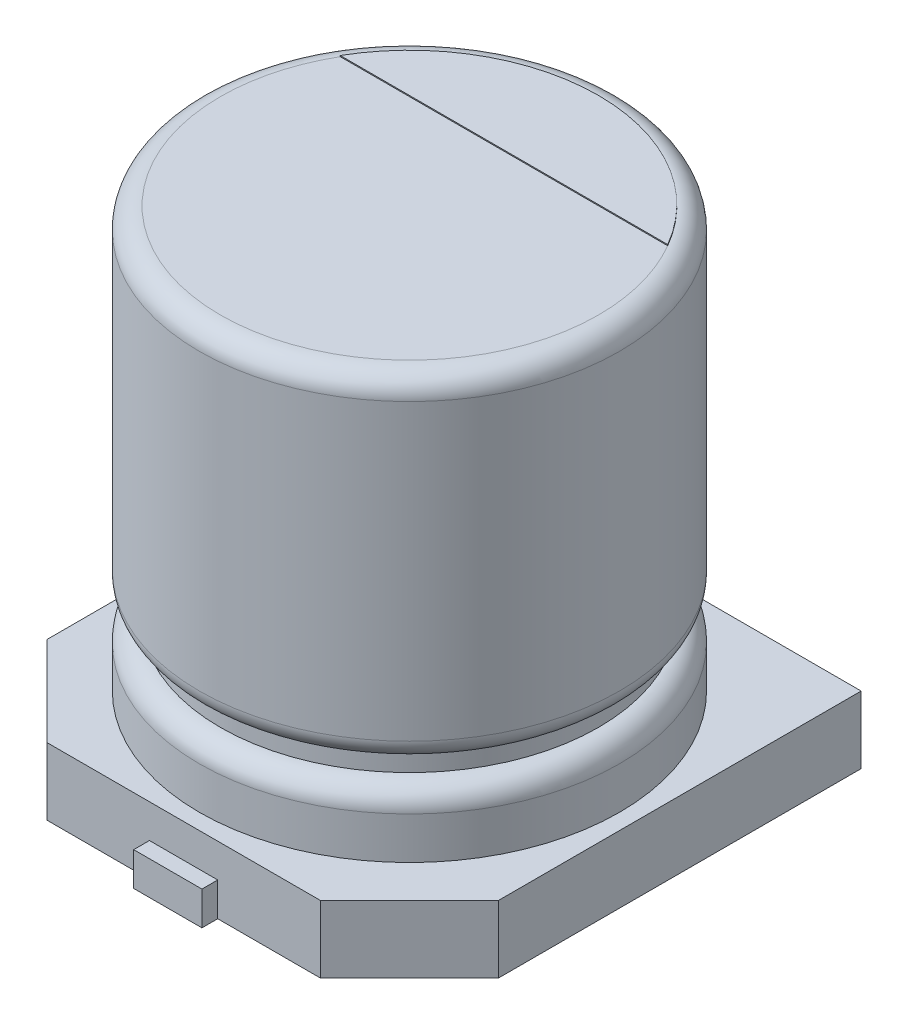
ISO-10303-21;
HEADER;
FILE_DESCRIPTION(('STEP AP214'),'2;1');
FILE_NAME('part.step','',(''),(''),'','','');
FILE_SCHEMA(('AUTOMOTIVE_DESIGN { 1 0 10303 214 1 1 1 1 }'));
ENDSEC;
DATA;
#1=APPLICATION_CONTEXT('core data for automotive mechanical design processes');
#2=APPLICATION_PROTOCOL_DEFINITION('international standard','automotive_design',2000,#1);
#3=PRODUCT_CONTEXT('',#1,'mechanical');
#4=PRODUCT('Part','Part','',(#3));
#5=PRODUCT_RELATED_PRODUCT_CATEGORY('part','',(#4));
#6=PRODUCT_DEFINITION_FORMATION('','',#4);
#7=PRODUCT_DEFINITION_CONTEXT('part definition',#1,'design');
#8=PRODUCT_DEFINITION('design','',#6,#7);
#9=PRODUCT_DEFINITION_SHAPE('','',#8);
#10=(LENGTH_UNIT() NAMED_UNIT(*) SI_UNIT(.MILLI.,.METRE.));
#11=(NAMED_UNIT(*) PLANE_ANGLE_UNIT() SI_UNIT($,.RADIAN.));
#12=(NAMED_UNIT(*) SI_UNIT($,.STERADIAN.) SOLID_ANGLE_UNIT());
#13=UNCERTAINTY_MEASURE_WITH_UNIT(LENGTH_MEASURE(1.E-05),#10,'distance_accuracy_value','');
#14=(GEOMETRIC_REPRESENTATION_CONTEXT(3) GLOBAL_UNCERTAINTY_ASSIGNED_CONTEXT((#13)) GLOBAL_UNIT_ASSIGNED_CONTEXT((#10,
#11,#12)) REPRESENTATION_CONTEXT('',''));
#15=CARTESIAN_POINT('',(0.,0.,0.));
#16=DIRECTION('',(0.,0.,1.));
#17=DIRECTION('',(1.,0.,0.));
#18=AXIS2_PLACEMENT_3D('',#15,#16,#17);
#19=CARTESIAN_POINT('',(-0.325,-0.64,-2.3));
#20=DIRECTION('',(0.,0.,1.));
#21=DIRECTION('',(0.,-1.,0.));
#22=AXIS2_PLACEMENT_3D('',#19,#20,#21);
#23=PLANE('',#22);
#24=DIRECTION('',(0.,1.,0.));
#25=VECTOR('',#24,1.);
#26=CARTESIAN_POINT('',(0.325,-0.64,-2.3));
#27=LINE('',#26,#25);
#28=CARTESIAN_POINT('',(0.325,-0.32,-2.3));
#29=VERTEX_POINT('',#28);
#30=CARTESIAN_POINT('',(0.325,-0.64,-2.3));
#31=VERTEX_POINT('',#30);
#32=EDGE_CURVE('E248',#29,#31,#27,.F.);
#33=ORIENTED_EDGE('',*,*,#32,.T.);
#34=DIRECTION('',(1.,0.,0.));
#35=VECTOR('',#34,1.);
#36=CARTESIAN_POINT('',(0.,-0.64,-2.3));
#37=LINE('',#36,#35);
#38=CARTESIAN_POINT('',(-0.325,-0.64,-2.3));
#39=VERTEX_POINT('',#38);
#40=EDGE_CURVE('E235',#39,#31,#37,.T.);
#41=ORIENTED_EDGE('',*,*,#40,.F.);
#42=DIRECTION('',(0.,1.,0.));
#43=VECTOR('',#42,1.);
#44=CARTESIAN_POINT('',(-0.325,-0.64,-2.3));
#45=LINE('',#44,#43);
#46=CARTESIAN_POINT('',(-0.325,-0.32,-2.3));
#47=VERTEX_POINT('',#46);
#48=EDGE_CURVE('E238',#39,#47,#45,.T.);
#49=ORIENTED_EDGE('',*,*,#48,.T.);
#50=DIRECTION('',(1.,0.,0.));
#51=VECTOR('',#50,1.);
#52=CARTESIAN_POINT('',(0.,-0.32,-2.3));
#53=LINE('',#52,#51);
#54=EDGE_CURVE('E243',#47,#29,#53,.T.);
#55=ORIENTED_EDGE('',*,*,#54,.T.);
#56=EDGE_LOOP('',(#33,#41,#49,#55));
#57=FACE_BOUND('',#56,.T.);
#58=ADVANCED_FACE('F17',(#57),#23,.F.);
#59=CARTESIAN_POINT('',(-0.325,-0.64,2.3));
#60=DIRECTION('',(0.,0.,-1.));
#61=DIRECTION('',(0.,1.,0.));
#62=AXIS2_PLACEMENT_3D('',#59,#60,#61);
#63=PLANE('',#62);
#64=DIRECTION('',(0.,1.,0.));
#65=VECTOR('',#64,1.);
#66=CARTESIAN_POINT('',(-0.325,-0.64,2.3));
#67=LINE('',#66,#65);
#68=CARTESIAN_POINT('',(-0.325,-0.32,2.3));
#69=VERTEX_POINT('',#68);
#70=CARTESIAN_POINT('',(-0.325,-0.64,2.3));
#71=VERTEX_POINT('',#70);
#72=EDGE_CURVE('E265',#69,#71,#67,.F.);
#73=ORIENTED_EDGE('',*,*,#72,.T.);
#74=DIRECTION('',(1.,0.,0.));
#75=VECTOR('',#74,1.);
#76=CARTESIAN_POINT('',(0.,-0.64,2.3));
#77=LINE('',#76,#75);
#78=CARTESIAN_POINT('',(0.325,-0.64,2.3));
#79=VERTEX_POINT('',#78);
#80=EDGE_CURVE('E232',#79,#71,#77,.F.);
#81=ORIENTED_EDGE('',*,*,#80,.F.);
#82=DIRECTION('',(0.,1.,0.));
#83=VECTOR('',#82,1.);
#84=CARTESIAN_POINT('',(0.325,-0.64,2.3));
#85=LINE('',#84,#83);
#86=CARTESIAN_POINT('',(0.325,-0.32,2.3));
#87=VERTEX_POINT('',#86);
#88=EDGE_CURVE('E255',#79,#87,#85,.T.);
#89=ORIENTED_EDGE('',*,*,#88,.T.);
#90=DIRECTION('',(1.,0.,0.));
#91=VECTOR('',#90,1.);
#92=CARTESIAN_POINT('',(0.,-0.32,2.3));
#93=LINE('',#92,#91);
#94=EDGE_CURVE('E260',#87,#69,#93,.F.);
#95=ORIENTED_EDGE('',*,*,#94,.T.);
#96=EDGE_LOOP('',(#73,#81,#89,#95));
#97=FACE_BOUND('',#96,.T.);
#98=ADVANCED_FACE('F557',(#97),#63,.F.);
#99=CARTESIAN_POINT('',(-0.325,-0.64,-0.5));
#100=DIRECTION('',(1.,0.,0.));
#101=DIRECTION('',(0.,0.,-1.));
#102=AXIS2_PLACEMENT_3D('',#99,#100,#101);
#103=PLANE('',#102);
#104=DIRECTION('',(0.,1.,0.));
#105=VECTOR('',#104,1.);
#106=CARTESIAN_POINT('',(-0.325,-0.64,-2.15));
#107=LINE('',#106,#105);
#108=CARTESIAN_POINT('',(-0.325,-0.64,-2.15));
#109=VERTEX_POINT('',#108);
#110=CARTESIAN_POINT('',(-0.325,-0.32,-2.15));
#111=VERTEX_POINT('',#110);
#112=EDGE_CURVE('E276',#109,#111,#107,.T.);
#113=ORIENTED_EDGE('',*,*,#112,.T.);
#114=DIRECTION('',(0.,0.,-1.));
#115=VECTOR('',#114,1.);
#116=CARTESIAN_POINT('',(-0.325,-0.32,0.));
#117=LINE('',#116,#115);
#118=EDGE_CURVE('E245',#111,#47,#117,.T.);
#119=ORIENTED_EDGE('',*,*,#118,.T.);
#120=ORIENTED_EDGE('',*,*,#48,.F.);
#121=DIRECTION('',(0.,0.,-1.));
#122=VECTOR('',#121,1.);
#123=CARTESIAN_POINT('',(-0.325,-0.64,-0.5));
#124=LINE('',#123,#122);
#125=EDGE_CURVE('E240',#109,#39,#124,.T.);
#126=ORIENTED_EDGE('',*,*,#125,.F.);
#127=EDGE_LOOP('',(#113,#119,#120,#126));
#128=FACE_BOUND('',#127,.T.);
#129=ADVANCED_FACE('F376',(#128),#103,.F.);
#130=CARTESIAN_POINT('',(0.,-0.32,0.));
#131=DIRECTION('',(0.,-1.,0.));
#132=DIRECTION('',(0.,0.,-1.));
#133=AXIS2_PLACEMENT_3D('',#130,#131,#132);
#134=PLANE('',#133);
#135=DIRECTION('',(1.,0.,0.));
#136=VECTOR('',#135,1.);
#137=CARTESIAN_POINT('',(-2.15,-0.32,-2.15));
#138=LINE('',#137,#136);
#139=CARTESIAN_POINT('',(0.325,-0.32,-2.15));
#140=VERTEX_POINT('',#139);
#141=EDGE_CURVE('E278',#111,#140,#138,.T.);
#142=ORIENTED_EDGE('',*,*,#141,.T.);
#143=DIRECTION('',(0.,0.,1.));
#144=VECTOR('',#143,1.);
#145=CARTESIAN_POINT('',(0.325,-0.32,-0.5));
#146=LINE('',#145,#144);
#147=EDGE_CURVE('E252',#140,#29,#146,.F.);
#148=ORIENTED_EDGE('',*,*,#147,.T.);
#149=ORIENTED_EDGE('',*,*,#54,.F.);
#150=ORIENTED_EDGE('',*,*,#118,.F.);
#151=EDGE_LOOP('',(#142,#148,#149,#150));
#152=FACE_BOUND('',#151,.T.);
#153=ADVANCED_FACE('F372',(#152),#134,.F.);
#154=CARTESIAN_POINT('',(0.325,-0.64,-0.5));
#155=DIRECTION('',(-1.,0.,0.));
#156=DIRECTION('',(0.,0.,1.));
#157=AXIS2_PLACEMENT_3D('',#154,#155,#156);
#158=PLANE('',#157);
#159=DIRECTION('',(0.,1.,0.));
#160=VECTOR('',#159,1.);
#161=CARTESIAN_POINT('',(0.325,-0.64,-2.15));
#162=LINE('',#161,#160);
#163=CARTESIAN_POINT('',(0.325,-0.64,-2.15));
#164=VERTEX_POINT('',#163);
#165=EDGE_CURVE('E280',#140,#164,#162,.F.);
#166=ORIENTED_EDGE('',*,*,#165,.T.);
#167=DIRECTION('',(0.,0.,1.));
#168=VECTOR('',#167,1.);
#169=CARTESIAN_POINT('',(0.325,-0.64,-0.5));
#170=LINE('',#169,#168);
#171=EDGE_CURVE('E250',#31,#164,#170,.T.);
#172=ORIENTED_EDGE('',*,*,#171,.F.);
#173=ORIENTED_EDGE('',*,*,#32,.F.);
#174=ORIENTED_EDGE('',*,*,#147,.F.);
#175=EDGE_LOOP('',(#166,#172,#173,#174));
#176=FACE_BOUND('',#175,.T.);
#177=ADVANCED_FACE('F368',(#176),#158,.F.);
#178=CARTESIAN_POINT('',(0.325,-0.64,0.5));
#179=DIRECTION('',(-1.,0.,0.));
#180=DIRECTION('',(0.,0.,1.));
#181=AXIS2_PLACEMENT_3D('',#178,#179,#180);
#182=PLANE('',#181);
#183=DIRECTION('',(0.,1.,0.));
#184=VECTOR('',#183,1.);
#185=CARTESIAN_POINT('',(0.325,-0.64,2.15));
#186=LINE('',#185,#184);
#187=CARTESIAN_POINT('',(0.325,-0.64,2.15));
#188=VERTEX_POINT('',#187);
#189=CARTESIAN_POINT('',(0.325,-0.32,2.15));
#190=VERTEX_POINT('',#189);
#191=EDGE_CURVE('E300',#188,#190,#186,.T.);
#192=ORIENTED_EDGE('',*,*,#191,.T.);
#193=DIRECTION('',(0.,0.,-1.));
#194=VECTOR('',#193,1.);
#195=CARTESIAN_POINT('',(0.325,-0.32,0.));
#196=LINE('',#195,#194);
#197=EDGE_CURVE('E262',#190,#87,#196,.F.);
#198=ORIENTED_EDGE('',*,*,#197,.T.);
#199=ORIENTED_EDGE('',*,*,#88,.F.);
#200=DIRECTION('',(0.,0.,1.));
#201=VECTOR('',#200,1.);
#202=CARTESIAN_POINT('',(0.325,-0.64,0.5));
#203=LINE('',#202,#201);
#204=EDGE_CURVE('E257',#188,#79,#203,.T.);
#205=ORIENTED_EDGE('',*,*,#204,.F.);
#206=EDGE_LOOP('',(#192,#198,#199,#205));
#207=FACE_BOUND('',#206,.T.);
#208=ADVANCED_FACE('F522',(#207),#182,.F.);
#209=CARTESIAN_POINT('',(0.,-0.32,0.));
#210=DIRECTION('',(0.,-1.,0.));
#211=DIRECTION('',(0.,0.,-1.));
#212=AXIS2_PLACEMENT_3D('',#209,#210,#211);
#213=PLANE('',#212);
#214=DIRECTION('',(-1.,0.,0.));
#215=VECTOR('',#214,1.);
#216=CARTESIAN_POINT('',(1.30147186257614,-0.32,2.15));
#217=LINE('',#216,#215);
#218=CARTESIAN_POINT('',(-0.325,-0.32,2.15));
#219=VERTEX_POINT('',#218);
#220=EDGE_CURVE('E302',#190,#219,#217,.T.);
#221=ORIENTED_EDGE('',*,*,#220,.T.);
#222=DIRECTION('',(0.,0.,-1.));
#223=VECTOR('',#222,1.);
#224=CARTESIAN_POINT('',(-0.325,-0.32,0.5));
#225=LINE('',#224,#223);
#226=EDGE_CURVE('E269',#219,#69,#225,.F.);
#227=ORIENTED_EDGE('',*,*,#226,.T.);
#228=ORIENTED_EDGE('',*,*,#94,.F.);
#229=ORIENTED_EDGE('',*,*,#197,.F.);
#230=EDGE_LOOP('',(#221,#227,#228,#229));
#231=FACE_BOUND('',#230,.T.);
#232=ADVANCED_FACE('F512',(#231),#213,.F.);
#233=CARTESIAN_POINT('',(-0.325,-0.64,0.5));
#234=DIRECTION('',(1.,0.,0.));
#235=DIRECTION('',(0.,0.,-1.));
#236=AXIS2_PLACEMENT_3D('',#233,#234,#235);
#237=PLANE('',#236);
#238=DIRECTION('',(0.,1.,0.));
#239=VECTOR('',#238,1.);
#240=CARTESIAN_POINT('',(-0.325,-0.64,2.15));
#241=LINE('',#240,#239);
#242=CARTESIAN_POINT('',(-0.325,-0.64,2.15));
#243=VERTEX_POINT('',#242);
#244=EDGE_CURVE('E304',#219,#243,#241,.F.);
#245=ORIENTED_EDGE('',*,*,#244,.T.);
#246=DIRECTION('',(0.,0.,-1.));
#247=VECTOR('',#246,1.);
#248=CARTESIAN_POINT('',(-0.325,-0.64,0.5));
#249=LINE('',#248,#247);
#250=EDGE_CURVE('E267',#71,#243,#249,.T.);
#251=ORIENTED_EDGE('',*,*,#250,.F.);
#252=ORIENTED_EDGE('',*,*,#72,.F.);
#253=ORIENTED_EDGE('',*,*,#226,.F.);
#254=EDGE_LOOP('',(#245,#251,#252,#253));
#255=FACE_BOUND('',#254,.T.);
#256=ADVANCED_FACE('F503',(#255),#237,.F.);
#257=CARTESIAN_POINT('',(0.,-0.64,0.));
#258=DIRECTION('',(0.,-1.,0.));
#259=DIRECTION('',(1.,0.,0.));
#260=AXIS2_PLACEMENT_3D('',#257,#258,#259);
#261=PLANE('',#260);
#262=DIRECTION('',(0.,0.,1.));
#263=VECTOR('',#262,1.);
#264=CARTESIAN_POINT('',(2.15,-0.64,-2.15));
#265=LINE('',#264,#263);
#266=CARTESIAN_POINT('',(2.15,-0.64,-2.15));
#267=VERTEX_POINT('',#266);
#268=CARTESIAN_POINT('',(2.15,-0.64,1.30147186257614));
#269=VERTEX_POINT('',#268);
#270=EDGE_CURVE('E286',#267,#269,#265,.T.);
#271=ORIENTED_EDGE('',*,*,#270,.T.);
#272=DIRECTION('',(-0.707106781186546,0.,0.707106781186549));
#273=VECTOR('',#272,1.);
#274=CARTESIAN_POINT('',(2.15,-0.64,1.30147186257614));
#275=LINE('',#274,#273);
#276=CARTESIAN_POINT('',(1.30147186257614,-0.64,2.15));
#277=VERTEX_POINT('',#276);
#278=EDGE_CURVE('E291',#269,#277,#275,.T.);
#279=ORIENTED_EDGE('',*,*,#278,.T.);
#280=DIRECTION('',(-1.,0.,0.));
#281=VECTOR('',#280,1.);
#282=CARTESIAN_POINT('',(1.30147186257614,-0.64,2.15));
#283=LINE('',#282,#281);
#284=EDGE_CURVE('E298',#277,#188,#283,.T.);
#285=ORIENTED_EDGE('',*,*,#284,.T.);
#286=ORIENTED_EDGE('',*,*,#204,.T.);
#287=ORIENTED_EDGE('',*,*,#80,.T.);
#288=ORIENTED_EDGE('',*,*,#250,.T.);
#289=DIRECTION('',(-1.,0.,0.));
#290=VECTOR('',#289,1.);
#291=CARTESIAN_POINT('',(1.30147186257614,-0.64,2.15));
#292=LINE('',#291,#290);
#293=CARTESIAN_POINT('',(-1.30147186257614,-0.64,2.15));
#294=VERTEX_POINT('',#293);
#295=EDGE_CURVE('E293',#243,#294,#292,.T.);
#296=ORIENTED_EDGE('',*,*,#295,.T.);
#297=DIRECTION('',(-0.707106781186546,0.,-0.707106781186549));
#298=VECTOR('',#297,1.);
#299=CARTESIAN_POINT('',(-1.30147186257614,-0.64,2.15));
#300=LINE('',#299,#298);
#301=CARTESIAN_POINT('',(-2.15,-0.64,1.30147186257614));
#302=VERTEX_POINT('',#301);
#303=EDGE_CURVE('E310',#294,#302,#300,.T.);
#304=ORIENTED_EDGE('',*,*,#303,.T.);
#305=DIRECTION('',(0.,0.,1.));
#306=VECTOR('',#305,1.);
#307=CARTESIAN_POINT('',(-2.15,-0.64,1.30147186257614));
#308=LINE('',#307,#306);
#309=CARTESIAN_POINT('',(-2.15,-0.64,-2.15));
#310=VERTEX_POINT('',#309);
#311=EDGE_CURVE('E315',#302,#310,#308,.F.);
#312=ORIENTED_EDGE('',*,*,#311,.T.);
#313=DIRECTION('',(1.,0.,0.));
#314=VECTOR('',#313,1.);
#315=CARTESIAN_POINT('',(-2.15,-0.64,-2.15));
#316=LINE('',#315,#314);
#317=EDGE_CURVE('E274',#310,#109,#316,.T.);
#318=ORIENTED_EDGE('',*,*,#317,.T.);
#319=ORIENTED_EDGE('',*,*,#125,.T.);
#320=ORIENTED_EDGE('',*,*,#40,.T.);
#321=ORIENTED_EDGE('',*,*,#171,.T.);
#322=DIRECTION('',(1.,0.,0.));
#323=VECTOR('',#322,1.);
#324=CARTESIAN_POINT('',(-2.15,-0.64,-2.15));
#325=LINE('',#324,#323);
#326=EDGE_CURVE('E272',#164,#267,#325,.T.);
#327=ORIENTED_EDGE('',*,*,#326,.T.);
#328=EDGE_LOOP('',(#271,#279,#285,#286,#287,#288,#296,#304,#312,#318,#319,#320,#321,#327));
#329=FACE_BOUND('',#328,.T.);
#330=ADVANCED_FACE('F362',(#329),#261,.T.);
#331=CARTESIAN_POINT('',(-2.15,-0.64,-2.15));
#332=DIRECTION('',(0.,0.,1.));
#333=DIRECTION('',(1.,0.,0.));
#334=AXIS2_PLACEMENT_3D('',#331,#332,#333);
#335=PLANE('',#334);
#336=ORIENTED_EDGE('',*,*,#141,.F.);
#337=ORIENTED_EDGE('',*,*,#112,.F.);
#338=ORIENTED_EDGE('',*,*,#317,.F.);
#339=DIRECTION('',(0.,1.,0.));
#340=VECTOR('',#339,1.);
#341=CARTESIAN_POINT('',(-2.15,-0.64,-2.15));
#342=LINE('',#341,#340);
#343=CARTESIAN_POINT('',(-2.15,0.,-2.15));
#344=VERTEX_POINT('',#343);
#345=EDGE_CURVE('E317',#310,#344,#342,.T.);
#346=ORIENTED_EDGE('',*,*,#345,.T.);
#347=DIRECTION('',(1.,0.,0.));
#348=VECTOR('',#347,1.);
#349=CARTESIAN_POINT('',(0.,0.,-2.15));
#350=LINE('',#349,#348);
#351=CARTESIAN_POINT('',(2.15,0.,-2.15));
#352=VERTEX_POINT('',#351);
#353=EDGE_CURVE('E319',#344,#352,#350,.T.);
#354=ORIENTED_EDGE('',*,*,#353,.T.);
#355=DIRECTION('',(0.,-1.,0.));
#356=VECTOR('',#355,1.);
#357=CARTESIAN_POINT('',(2.15,-0.64,-2.15));
#358=LINE('',#357,#356);
#359=EDGE_CURVE('E283',#352,#267,#358,.T.);
#360=ORIENTED_EDGE('',*,*,#359,.T.);
#361=ORIENTED_EDGE('',*,*,#326,.F.);
#362=ORIENTED_EDGE('',*,*,#165,.F.);
#363=EDGE_LOOP('',(#336,#337,#338,#346,#354,#360,#361,#362));
#364=FACE_BOUND('',#363,.T.);
#365=ADVANCED_FACE('F353',(#364),#335,.F.);
#366=CARTESIAN_POINT('',(2.15,-0.64,-2.15));
#367=DIRECTION('',(-1.,0.,0.));
#368=DIRECTION('',(0.,-1.,0.));
#369=AXIS2_PLACEMENT_3D('',#366,#367,#368);
#370=PLANE('',#369);
#371=DIRECTION('',(0.,1.,0.));
#372=VECTOR('',#371,1.);
#373=CARTESIAN_POINT('',(2.15,-0.64,1.30147186257614));
#374=LINE('',#373,#372);
#375=CARTESIAN_POINT('',(2.15,0.,1.30147186257614));
#376=VERTEX_POINT('',#375);
#377=EDGE_CURVE('E288',#376,#269,#374,.F.);
#378=ORIENTED_EDGE('',*,*,#377,.T.);
#379=ORIENTED_EDGE('',*,*,#270,.F.);
#380=ORIENTED_EDGE('',*,*,#359,.F.);
#381=DIRECTION('',(0.,0.,1.));
#382=VECTOR('',#381,1.);
#383=CARTESIAN_POINT('',(2.15,0.,0.));
#384=LINE('',#383,#382);
#385=EDGE_CURVE('E321',#352,#376,#384,.T.);
#386=ORIENTED_EDGE('',*,*,#385,.T.);
#387=EDGE_LOOP('',(#378,#379,#380,#386));
#388=FACE_BOUND('',#387,.T.);
#389=ADVANCED_FACE('F358',(#388),#370,.F.);
#390=CARTESIAN_POINT('',(2.15,-0.64,1.30147186257614));
#391=DIRECTION('',(-0.707106781186549,0.,-0.707106781186546));
#392=DIRECTION('',(-0.707106781186546,0.,0.707106781186549));
#393=AXIS2_PLACEMENT_3D('',#390,#391,#392);
#394=PLANE('',#393);
#395=DIRECTION('',(0.,1.,0.));
#396=VECTOR('',#395,1.);
#397=CARTESIAN_POINT('',(1.30147186257614,-0.64,2.15));
#398=LINE('',#397,#396);
#399=CARTESIAN_POINT('',(1.30147186257614,0.,2.15));
#400=VERTEX_POINT('',#399);
#401=EDGE_CURVE('E295',#400,#277,#398,.F.);
#402=ORIENTED_EDGE('',*,*,#401,.T.);
#403=ORIENTED_EDGE('',*,*,#278,.F.);
#404=ORIENTED_EDGE('',*,*,#377,.F.);
#405=DIRECTION('',(-0.707106781186547,0.,0.707106781186547));
#406=VECTOR('',#405,1.);
#407=CARTESIAN_POINT('',(2.15,0.,1.30147186257614));
#408=LINE('',#407,#406);
#409=EDGE_CURVE('E323',#376,#400,#408,.T.);
#410=ORIENTED_EDGE('',*,*,#409,.T.);
#411=EDGE_LOOP('',(#402,#403,#404,#410));
#412=FACE_BOUND('',#411,.T.);
#413=ADVANCED_FACE('F391',(#412),#394,.F.);
#414=CARTESIAN_POINT('',(1.30147186257614,-0.64,2.15));
#415=DIRECTION('',(0.,0.,-1.));
#416=DIRECTION('',(-1.,0.,0.));
#417=AXIS2_PLACEMENT_3D('',#414,#415,#416);
#418=PLANE('',#417);
#419=ORIENTED_EDGE('',*,*,#220,.F.);
#420=ORIENTED_EDGE('',*,*,#191,.F.);
#421=ORIENTED_EDGE('',*,*,#284,.F.);
#422=ORIENTED_EDGE('',*,*,#401,.F.);
#423=DIRECTION('',(1.,0.,0.));
#424=VECTOR('',#423,1.);
#425=CARTESIAN_POINT('',(0.,0.,2.15));
#426=LINE('',#425,#424);
#427=CARTESIAN_POINT('',(-1.30147186257614,0.,2.15));
#428=VERTEX_POINT('',#427);
#429=EDGE_CURVE('E325',#400,#428,#426,.F.);
#430=ORIENTED_EDGE('',*,*,#429,.T.);
#431=DIRECTION('',(0.,1.,0.));
#432=VECTOR('',#431,1.);
#433=CARTESIAN_POINT('',(-1.30147186257614,-0.64,2.15));
#434=LINE('',#433,#432);
#435=EDGE_CURVE('E307',#428,#294,#434,.F.);
#436=ORIENTED_EDGE('',*,*,#435,.T.);
#437=ORIENTED_EDGE('',*,*,#295,.F.);
#438=ORIENTED_EDGE('',*,*,#244,.F.);
#439=EDGE_LOOP('',(#419,#420,#421,#422,#430,#436,#437,#438));
#440=FACE_BOUND('',#439,.T.);
#441=ADVANCED_FACE('F383',(#440),#418,.F.);
#442=CARTESIAN_POINT('',(-1.30147186257614,-0.64,2.15));
#443=DIRECTION('',(0.707106781186549,0.,-0.707106781186546));
#444=DIRECTION('',(-0.707106781186546,0.,-0.707106781186549));
#445=AXIS2_PLACEMENT_3D('',#442,#443,#444);
#446=PLANE('',#445);
#447=DIRECTION('',(0.,1.,0.));
#448=VECTOR('',#447,1.);
#449=CARTESIAN_POINT('',(-2.15,-0.64,1.30147186257614));
#450=LINE('',#449,#448);
#451=CARTESIAN_POINT('',(-2.15,0.,1.30147186257614));
#452=VERTEX_POINT('',#451);
#453=EDGE_CURVE('E312',#452,#302,#450,.F.);
#454=ORIENTED_EDGE('',*,*,#453,.T.);
#455=ORIENTED_EDGE('',*,*,#303,.F.);
#456=ORIENTED_EDGE('',*,*,#435,.F.);
#457=DIRECTION('',(-0.707106781186547,0.,-0.707106781186547));
#458=VECTOR('',#457,1.);
#459=CARTESIAN_POINT('',(-1.30147186257614,0.,2.15));
#460=LINE('',#459,#458);
#461=EDGE_CURVE('E326',#428,#452,#460,.T.);
#462=ORIENTED_EDGE('',*,*,#461,.T.);
#463=EDGE_LOOP('',(#454,#455,#456,#462));
#464=FACE_BOUND('',#463,.T.);
#465=ADVANCED_FACE('F381',(#464),#446,.F.);
#466=CARTESIAN_POINT('',(-2.15,-0.64,1.30147186257614));
#467=DIRECTION('',(1.,0.,0.));
#468=DIRECTION('',(0.,1.,0.));
#469=AXIS2_PLACEMENT_3D('',#466,#467,#468);
#470=PLANE('',#469);
#471=ORIENTED_EDGE('',*,*,#345,.F.);
#472=ORIENTED_EDGE('',*,*,#311,.F.);
#473=ORIENTED_EDGE('',*,*,#453,.F.);
#474=DIRECTION('',(0.,0.,1.));
#475=VECTOR('',#474,1.);
#476=CARTESIAN_POINT('',(-2.15,0.,0.));
#477=LINE('',#476,#475);
#478=EDGE_CURVE('E203',#452,#344,#477,.F.);
#479=ORIENTED_EDGE('',*,*,#478,.T.);
#480=EDGE_LOOP('',(#471,#472,#473,#479));
#481=FACE_BOUND('',#480,.T.);
#482=ADVANCED_FACE('F345',(#481),#470,.F.);
#483=CARTESIAN_POINT('',(0.,0.,0.));
#484=DIRECTION('',(0.,-1.,0.));
#485=DIRECTION('',(1.,0.,0.));
#486=AXIS2_PLACEMENT_3D('',#483,#484,#485);
#487=PLANE('',#486);
#488=CARTESIAN_POINT('',(0.,0.,0.));
#489=DIRECTION('',(0.,1.,0.));
#490=DIRECTION('',(-1.,0.,0.));
#491=AXIS2_PLACEMENT_3D('',#488,#489,#490);
#492=CIRCLE('',#491,2.);
#493=CARTESIAN_POINT('',(-2.,0.,0.));
#494=VERTEX_POINT('',#493);
#495=EDGE_CURVE('E20',#494,#494,#492,.T.);
#496=ORIENTED_EDGE('',*,*,#495,.F.);
#497=EDGE_LOOP('',(#496));
#498=FACE_BOUND('',#497,.T.);
#499=ORIENTED_EDGE('',*,*,#461,.F.);
#500=ORIENTED_EDGE('',*,*,#429,.F.);
#501=ORIENTED_EDGE('',*,*,#409,.F.);
#502=ORIENTED_EDGE('',*,*,#385,.F.);
#503=ORIENTED_EDGE('',*,*,#353,.F.);
#504=ORIENTED_EDGE('',*,*,#478,.F.);
#505=EDGE_LOOP('',(#499,#500,#501,#502,#503,#504));
#506=FACE_BOUND('',#505,.T.);
#507=ADVANCED_FACE('F342',(#498,#506),#487,.F.);
#508=CARTESIAN_POINT('',(0.,8.08222988146831,0.));
#509=DIRECTION('',(0.,1.,0.));
#510=DIRECTION('',(-1.,0.,0.));
#511=AXIS2_PLACEMENT_3D('',#508,#509,#510);
#512=CYLINDRICAL_SURFACE('',#511,2.);
#513=ORIENTED_EDGE('',*,*,#495,.T.);
#514=EDGE_LOOP('',(#513));
#515=FACE_BOUND('',#514,.T.);
#516=CARTESIAN_POINT('',(0.,0.4,0.));
#517=DIRECTION('',(0.,1.,0.));
#518=DIRECTION('',(-1.,0.,0.));
#519=AXIS2_PLACEMENT_3D('',#516,#517,#518);
#520=CIRCLE('',#519,2.);
#521=CARTESIAN_POINT('',(-2.,0.4,0.));
#522=VERTEX_POINT('',#521);
#523=EDGE_CURVE('E158',#522,#522,#520,.T.);
#524=ORIENTED_EDGE('',*,*,#523,.F.);
#525=EDGE_LOOP('',(#524));
#526=FACE_BOUND('',#525,.T.);
#527=ADVANCED_FACE('F339',(#515,#526),#512,.T.);
#528=CARTESIAN_POINT('',(-1.55884572681199,4.01,-0.899999999999999));
#529=DIRECTION('',(0.,0.,-1.));
#530=DIRECTION('',(-1.,0.,0.));
#531=AXIS2_PLACEMENT_3D('',#528,#529,#530);
#532=PLANE('',#531);
#533=DIRECTION('',(0.,1.,0.));
#534=VECTOR('',#533,1.);
#535=CARTESIAN_POINT('',(1.55884572681199,4.01,-0.899999999999999));
#536=LINE('',#535,#534);
#537=CARTESIAN_POINT('',(1.55884572681199,4.01,-0.899999999999999));
#538=VERTEX_POINT('',#537);
#539=CARTESIAN_POINT('',(1.55884572681199,4.,-0.899999999999999));
#540=VERTEX_POINT('',#539);
#541=EDGE_CURVE('E131',#538,#540,#536,.F.);
#542=ORIENTED_EDGE('',*,*,#541,.F.);
#543=DIRECTION('',(-1.,0.,0.));
#544=VECTOR('',#543,1.);
#545=CARTESIAN_POINT('',(0.,4.01,-0.899999999999999));
#546=LINE('',#545,#544);
#547=CARTESIAN_POINT('',(-1.55884572681199,4.01,-0.899999999999999));
#548=VERTEX_POINT('',#547);
#549=EDGE_CURVE('E139',#548,#538,#546,.F.);
#550=ORIENTED_EDGE('',*,*,#549,.F.);
#551=DIRECTION('',(0.,1.,0.));
#552=VECTOR('',#551,1.);
#553=CARTESIAN_POINT('',(-1.55884572681199,4.01,-0.899999999999999));
#554=LINE('',#553,#552);
#555=CARTESIAN_POINT('',(-1.55884572681199,4.,-0.899999999999999));
#556=VERTEX_POINT('',#555);
#557=EDGE_CURVE('E35',#556,#548,#554,.T.);
#558=ORIENTED_EDGE('',*,*,#557,.F.);
#559=DIRECTION('',(-1.,0.,0.));
#560=VECTOR('',#559,1.);
#561=CARTESIAN_POINT('',(0.,4.,-0.899999999999999));
#562=LINE('',#561,#560);
#563=EDGE_CURVE('E151',#540,#556,#562,.T.);
#564=ORIENTED_EDGE('',*,*,#563,.F.);
#565=EDGE_LOOP('',(#542,#550,#558,#564));
#566=FACE_BOUND('',#565,.T.);
#567=ADVANCED_FACE('F152',(#566),#532,.F.);
#568=CARTESIAN_POINT('',(0.,4.01,0.));
#569=DIRECTION('',(0.,1.,0.));
#570=DIRECTION('',(-1.,0.,0.));
#571=AXIS2_PLACEMENT_3D('',#568,#569,#570);
#572=PLANE('',#571);
#573=CARTESIAN_POINT('',(0.,4.01,0.));
#574=DIRECTION('',(0.,-1.,0.));
#575=DIRECTION('',(1.,0.,0.));
#576=AXIS2_PLACEMENT_3D('',#573,#574,#575);
#577=CIRCLE('',#576,1.8);
#578=EDGE_CURVE('E137',#548,#538,#577,.T.);
#579=ORIENTED_EDGE('',*,*,#578,.F.);
#580=ORIENTED_EDGE('',*,*,#549,.T.);
#581=EDGE_LOOP('',(#579,#580));
#582=FACE_BOUND('',#581,.T.);
#583=ADVANCED_FACE('F182',(#582),#572,.T.);
#584=CARTESIAN_POINT('',(0.,0.4,0.));
#585=DIRECTION('',(0.,1.,0.));
#586=DIRECTION('',(-1.,0.,0.));
#587=AXIS2_PLACEMENT_3D('',#584,#585,#586);
#588=TOROIDAL_SURFACE('',#587,1.8,0.2);
#589=ORIENTED_EDGE('',*,*,#523,.T.);
#590=EDGE_LOOP('',(#589));
#591=FACE_BOUND('',#590,.T.);
#592=CARTESIAN_POINT('',(0.,0.6,0.));
#593=DIRECTION('',(0.,1.,0.));
#594=DIRECTION('',(-1.,0.,0.));
#595=AXIS2_PLACEMENT_3D('',#592,#593,#594);
#596=CIRCLE('',#595,1.8);
#597=CARTESIAN_POINT('',(-1.8,0.6,0.));
#598=VERTEX_POINT('',#597);
#599=EDGE_CURVE('E225',#598,#598,#596,.T.);
#600=ORIENTED_EDGE('',*,*,#599,.F.);
#601=EDGE_LOOP('',(#600));
#602=FACE_BOUND('',#601,.T.);
#603=ADVANCED_FACE('F176',(#591,#602),#588,.T.);
#604=CARTESIAN_POINT('',(0.,4.,0.));
#605=DIRECTION('',(0.,1.,0.));
#606=DIRECTION('',(-1.,0.,0.));
#607=AXIS2_PLACEMENT_3D('',#604,#605,#606);
#608=PLANE('',#607);
#609=CARTESIAN_POINT('',(0.,4.,0.));
#610=DIRECTION('',(0.,-1.,0.));
#611=DIRECTION('',(0.866025403784439,0.,-0.499999999999999));
#612=AXIS2_PLACEMENT_3D('',#609,#610,#611);
#613=CIRCLE('',#612,1.8);
#614=CARTESIAN_POINT('',(1.8,4.,0.));
#615=VERTEX_POINT('',#614);
#616=EDGE_CURVE('E144',#615,#540,#613,.F.);
#617=ORIENTED_EDGE('',*,*,#616,.T.);
#618=ORIENTED_EDGE('',*,*,#563,.T.);
#619=CARTESIAN_POINT('',(0.,4.,0.));
#620=DIRECTION('',(0.,-1.,0.));
#621=DIRECTION('',(1.,0.,0.));
#622=AXIS2_PLACEMENT_3D('',#619,#620,#621);
#623=CIRCLE('',#622,1.8);
#624=EDGE_CURVE('E147',#615,#556,#623,.T.);
#625=ORIENTED_EDGE('',*,*,#624,.F.);
#626=EDGE_LOOP('',(#617,#618,#625));
#627=FACE_BOUND('',#626,.T.);
#628=ADVANCED_FACE('F156',(#627),#608,.T.);
#629=CARTESIAN_POINT('',(0.,4.01,0.));
#630=DIRECTION('',(0.,-1.,0.));
#631=DIRECTION('',(1.,0.,0.));
#632=AXIS2_PLACEMENT_3D('',#629,#630,#631);
#633=CYLINDRICAL_SURFACE('',#632,1.8);
#634=ORIENTED_EDGE('',*,*,#578,.T.);
#635=ORIENTED_EDGE('',*,*,#541,.T.);
#636=CARTESIAN_POINT('',(0.,4.,0.));
#637=DIRECTION('',(0.,1.,0.));
#638=DIRECTION('',(-1.,0.,0.));
#639=AXIS2_PLACEMENT_3D('',#636,#637,#638);
#640=CIRCLE('',#639,1.8);
#641=EDGE_CURVE('E134',#556,#540,#640,.F.);
#642=ORIENTED_EDGE('',*,*,#641,.F.);
#643=ORIENTED_EDGE('',*,*,#557,.T.);
#644=EDGE_LOOP('',(#634,#635,#642,#643));
#645=FACE_BOUND('',#644,.T.);
#646=ADVANCED_FACE('F133',(#645),#633,.T.);
#647=CARTESIAN_POINT('',(0.,8.08222988146831,0.));
#648=DIRECTION('',(0.,1.,0.));
#649=DIRECTION('',(-1.,0.,0.));
#650=AXIS2_PLACEMENT_3D('',#647,#648,#649);
#651=CYLINDRICAL_SURFACE('',#650,1.8);
#652=ORIENTED_EDGE('',*,*,#599,.T.);
#653=EDGE_LOOP('',(#652));
#654=FACE_BOUND('',#653,.T.);
#655=CARTESIAN_POINT('',(0.,0.8,0.));
#656=DIRECTION('',(0.,1.,0.));
#657=DIRECTION('',(-1.,0.,0.));
#658=AXIS2_PLACEMENT_3D('',#655,#656,#657);
#659=CIRCLE('',#658,1.8);
#660=CARTESIAN_POINT('',(-1.8,0.8,0.));
#661=VERTEX_POINT('',#660);
#662=EDGE_CURVE('E149',#661,#661,#659,.T.);
#663=ORIENTED_EDGE('',*,*,#662,.F.);
#664=EDGE_LOOP('',(#663));
#665=FACE_BOUND('',#664,.T.);
#666=ADVANCED_FACE('F215',(#654,#665),#651,.T.);
#667=CARTESIAN_POINT('',(0.,3.8,0.));
#668=DIRECTION('',(0.,1.,0.));
#669=DIRECTION('',(-1.,0.,0.));
#670=AXIS2_PLACEMENT_3D('',#667,#668,#669);
#671=TOROIDAL_SURFACE('',#670,1.8,0.2);
#672=CARTESIAN_POINT('',(0.,3.8,0.));
#673=DIRECTION('',(0.,1.,0.));
#674=DIRECTION('',(-1.,0.,0.));
#675=AXIS2_PLACEMENT_3D('',#672,#673,#674);
#676=CIRCLE('',#675,2.);
#677=CARTESIAN_POINT('',(-2.,3.8,0.));
#678=VERTEX_POINT('',#677);
#679=EDGE_CURVE('E26',#678,#678,#676,.F.);
#680=ORIENTED_EDGE('',*,*,#679,.F.);
#681=EDGE_LOOP('',(#680));
#682=FACE_BOUND('',#681,.T.);
#683=ORIENTED_EDGE('',*,*,#616,.F.);
#684=ORIENTED_EDGE('',*,*,#624,.T.);
#685=ORIENTED_EDGE('',*,*,#641,.T.);
#686=EDGE_LOOP('',(#683,#684,#685));
#687=FACE_BOUND('',#686,.T.);
#688=ADVANCED_FACE('F142',(#682,#687),#671,.T.);
#689=CARTESIAN_POINT('',(0.,1.,0.));
#690=DIRECTION('',(0.,1.,0.));
#691=DIRECTION('',(-1.,0.,0.));
#692=AXIS2_PLACEMENT_3D('',#689,#690,#691);
#693=TOROIDAL_SURFACE('',#692,1.8,0.2);
#694=ORIENTED_EDGE('',*,*,#662,.T.);
#695=EDGE_LOOP('',(#694));
#696=FACE_BOUND('',#695,.T.);
#697=CARTESIAN_POINT('',(0.,0.999999999999999,0.));
#698=DIRECTION('',(0.,1.,0.));
#699=DIRECTION('',(-1.,0.,0.));
#700=AXIS2_PLACEMENT_3D('',#697,#698,#699);
#701=CIRCLE('',#700,2.);
#702=CARTESIAN_POINT('',(-2.,0.999999999999999,0.));
#703=VERTEX_POINT('',#702);
#704=EDGE_CURVE('E11',#703,#703,#701,.T.);
#705=ORIENTED_EDGE('',*,*,#704,.F.);
#706=EDGE_LOOP('',(#705));
#707=FACE_BOUND('',#706,.T.);
#708=ADVANCED_FACE('F214',(#696,#707),#693,.T.);
#709=CARTESIAN_POINT('',(0.,8.08222988146831,0.));
#710=DIRECTION('',(0.,1.,0.));
#711=DIRECTION('',(-1.,0.,0.));
#712=AXIS2_PLACEMENT_3D('',#709,#710,#711);
#713=CYLINDRICAL_SURFACE('',#712,2.);
#714=ORIENTED_EDGE('',*,*,#704,.T.);
#715=EDGE_LOOP('',(#714));
#716=FACE_BOUND('',#715,.T.);
#717=ORIENTED_EDGE('',*,*,#679,.T.);
#718=EDGE_LOOP('',(#717));
#719=FACE_BOUND('',#718,.T.);
#720=ADVANCED_FACE('F394',(#716,#719),#713,.T.);
#721=CLOSED_SHELL('',(#58,#98,#129,#153,#177,#208,#232,#256,#330,#365,#389,#413,#441,#465,#482,
#507,#527,#567,#583,#603,#628,#646,#666,#688,#708,#720));
#722=MANIFOLD_SOLID_BREP('B1',#721);
#723=ADVANCED_BREP_SHAPE_REPRESENTATION('',(#18,#722),#14);
#724=SHAPE_DEFINITION_REPRESENTATION(#9,#723);
ENDSEC;
END-ISO-10303-21;
